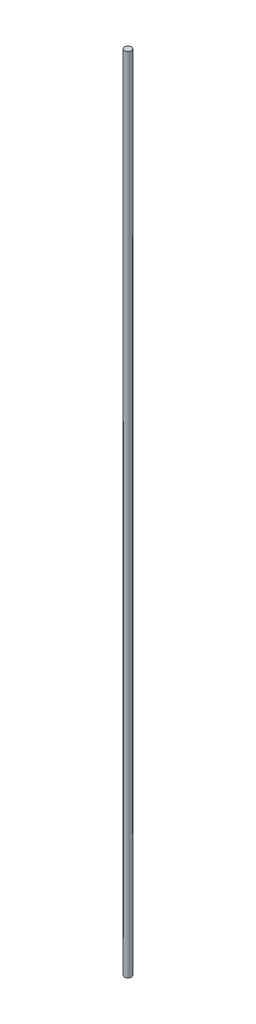
ISO-10303-21;
HEADER;
FILE_DESCRIPTION(('STEP AP214'),'2;1');
FILE_NAME('part.step','',(''),(''),'','','');
FILE_SCHEMA(('AUTOMOTIVE_DESIGN { 1 0 10303 214 1 1 1 1 }'));
ENDSEC;
DATA;
#1=APPLICATION_CONTEXT('core data for automotive mechanical design processes');
#2=APPLICATION_PROTOCOL_DEFINITION('international standard','automotive_design',2000,#1);
#3=PRODUCT_CONTEXT('',#1,'mechanical');
#4=PRODUCT('Part','Part','',(#3));
#5=PRODUCT_RELATED_PRODUCT_CATEGORY('part','',(#4));
#6=PRODUCT_DEFINITION_FORMATION('','',#4);
#7=PRODUCT_DEFINITION_CONTEXT('part definition',#1,'design');
#8=PRODUCT_DEFINITION('design','',#6,#7);
#9=PRODUCT_DEFINITION_SHAPE('','',#8);
#10=(LENGTH_UNIT() NAMED_UNIT(*) SI_UNIT(.MILLI.,.METRE.));
#11=(NAMED_UNIT(*) PLANE_ANGLE_UNIT() SI_UNIT($,.RADIAN.));
#12=(NAMED_UNIT(*) SI_UNIT($,.STERADIAN.) SOLID_ANGLE_UNIT());
#13=UNCERTAINTY_MEASURE_WITH_UNIT(LENGTH_MEASURE(1.E-05),#10,'distance_accuracy_value','');
#14=(GEOMETRIC_REPRESENTATION_CONTEXT(3) GLOBAL_UNCERTAINTY_ASSIGNED_CONTEXT((#13)) GLOBAL_UNIT_ASSIGNED_CONTEXT((#10,
#11,#12)) REPRESENTATION_CONTEXT('',''));
#15=CARTESIAN_POINT('',(0.,0.,0.));
#16=DIRECTION('',(0.,0.,1.));
#17=DIRECTION('',(1.,0.,0.));
#18=AXIS2_PLACEMENT_3D('',#15,#16,#17);
#19=CARTESIAN_POINT('',(0.,6000.,0.));
#20=DIRECTION('',(0.,-1.,0.));
#21=DIRECTION('',(0.,0.,-1.));
#22=AXIS2_PLACEMENT_3D('',#19,#20,#21);
#23=CYLINDRICAL_SURFACE('',#22,25.5);
#24=CARTESIAN_POINT('',(0.,6000.,0.));
#25=DIRECTION('',(0.,1.,0.));
#26=DIRECTION('',(0.,0.,1.));
#27=AXIS2_PLACEMENT_3D('',#24,#25,#26);
#28=CIRCLE('',#27,25.5);
#29=CARTESIAN_POINT('',(0.,6000.,25.5));
#30=VERTEX_POINT('',#29);
#31=EDGE_CURVE('E10',#30,#30,#28,.T.);
#32=ORIENTED_EDGE('',*,*,#31,.F.);
#33=EDGE_LOOP('',(#32));
#34=FACE_BOUND('',#33,.T.);
#35=CARTESIAN_POINT('',(0.,0.,0.));
#36=DIRECTION('',(0.,1.,0.));
#37=DIRECTION('',(0.,0.,1.));
#38=AXIS2_PLACEMENT_3D('',#35,#36,#37);
#39=CIRCLE('',#38,25.5);
#40=CARTESIAN_POINT('',(0.,0.,25.5));
#41=VERTEX_POINT('',#40);
#42=EDGE_CURVE('E46',#41,#41,#39,.T.);
#43=ORIENTED_EDGE('',*,*,#42,.T.);
#44=EDGE_LOOP('',(#43));
#45=FACE_BOUND('',#44,.T.);
#46=ADVANCED_FACE('F43',(#34,#45),#23,.T.);
#47=CARTESIAN_POINT('',(0.,6000.,0.));
#48=DIRECTION('',(0.,1.,0.));
#49=DIRECTION('',(0.,0.,1.));
#50=AXIS2_PLACEMENT_3D('',#47,#48,#49);
#51=PLANE('',#50);
#52=ORIENTED_EDGE('',*,*,#31,.T.);
#53=EDGE_LOOP('',(#52));
#54=FACE_BOUND('',#53,.T.);
#55=ADVANCED_FACE('F60',(#54),#51,.T.);
#56=CARTESIAN_POINT('',(0.,0.,0.));
#57=DIRECTION('',(0.,1.,0.));
#58=DIRECTION('',(0.,0.,1.));
#59=AXIS2_PLACEMENT_3D('',#56,#57,#58);
#60=PLANE('',#59);
#61=ORIENTED_EDGE('',*,*,#42,.F.);
#62=EDGE_LOOP('',(#61));
#63=FACE_BOUND('',#62,.T.);
#64=ADVANCED_FACE('F58',(#63),#60,.F.);
#65=CLOSED_SHELL('',(#46,#55,#64));
#66=MANIFOLD_SOLID_BREP('B2',#65);
#67=ADVANCED_BREP_SHAPE_REPRESENTATION('',(#18,#66),#14);
#68=SHAPE_DEFINITION_REPRESENTATION(#9,#67);
ENDSEC;
END-ISO-10303-21;
